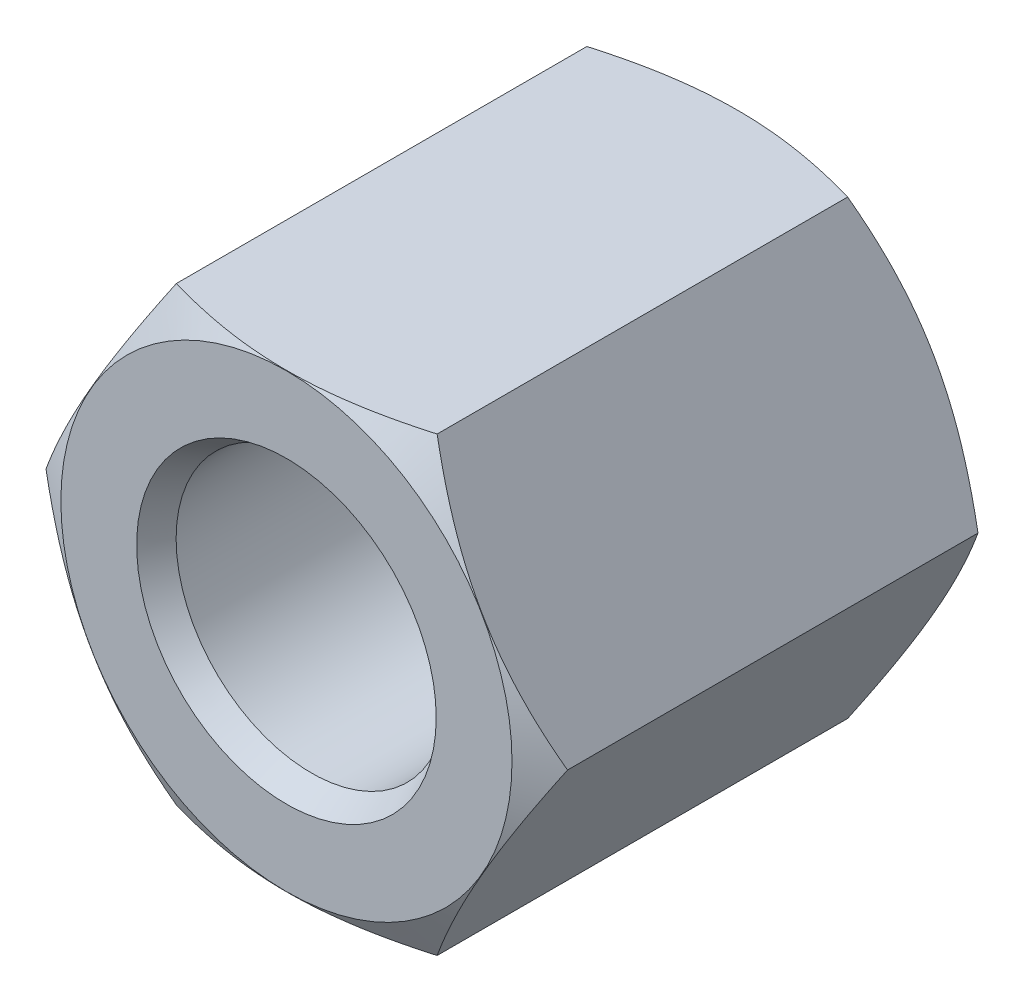
ISO-10303-21;
HEADER;
FILE_DESCRIPTION(('STEP AP214'),'2;1');
FILE_NAME('part.step','',(''),(''),'','','');
FILE_SCHEMA(('AUTOMOTIVE_DESIGN { 1 0 10303 214 1 1 1 1 }'));
ENDSEC;
DATA;
#1=APPLICATION_CONTEXT('core data for automotive mechanical design processes');
#2=APPLICATION_PROTOCOL_DEFINITION('international standard','automotive_design',2000,#1);
#3=PRODUCT_CONTEXT('',#1,'mechanical');
#4=PRODUCT('Part','Part','',(#3));
#5=PRODUCT_RELATED_PRODUCT_CATEGORY('part','',(#4));
#6=PRODUCT_DEFINITION_FORMATION('','',#4);
#7=PRODUCT_DEFINITION_CONTEXT('part definition',#1,'design');
#8=PRODUCT_DEFINITION('design','',#6,#7);
#9=PRODUCT_DEFINITION_SHAPE('','',#8);
#10=(LENGTH_UNIT() NAMED_UNIT(*) SI_UNIT(.MILLI.,.METRE.));
#11=(NAMED_UNIT(*) PLANE_ANGLE_UNIT() SI_UNIT($,.RADIAN.));
#12=(NAMED_UNIT(*) SI_UNIT($,.STERADIAN.) SOLID_ANGLE_UNIT());
#13=UNCERTAINTY_MEASURE_WITH_UNIT(LENGTH_MEASURE(1.E-05),#10,'distance_accuracy_value','');
#14=(GEOMETRIC_REPRESENTATION_CONTEXT(3) GLOBAL_UNCERTAINTY_ASSIGNED_CONTEXT((#13)) GLOBAL_UNIT_ASSIGNED_CONTEXT((#10,
#11,#12)) REPRESENTATION_CONTEXT('',''));
#15=CARTESIAN_POINT('',(0.,0.,0.));
#16=DIRECTION('',(0.,0.,1.));
#17=DIRECTION('',(1.,0.,0.));
#18=AXIS2_PLACEMENT_3D('',#15,#16,#17);
#19=CARTESIAN_POINT('',(0.,0.,4.72287187079));
#20=DIRECTION('',(0.,0.,-1.));
#21=DIRECTION('',(1.,0.,0.));
#22=AXIS2_PLACEMENT_3D('',#19,#20,#21);
#23=CYLINDRICAL_SURFACE('',#22,1.5);
#24=CARTESIAN_POINT('',(0.,0.,4.72287187079));
#25=DIRECTION('',(0.,0.,1.));
#26=DIRECTION('',(1.,0.,0.));
#27=AXIS2_PLACEMENT_3D('',#24,#25,#26);
#28=CIRCLE('',#27,1.5);
#29=CARTESIAN_POINT('',(1.5,0.,4.72287187079));
#30=VERTEX_POINT('',#29);
#31=EDGE_CURVE('E132',#30,#30,#28,.T.);
#32=ORIENTED_EDGE('',*,*,#31,.T.);
#33=DIRECTION('',(0.,0.,-1.));
#34=VECTOR('',#33,1.);
#35=CARTESIAN_POINT('',(1.5,0.,4.72287187079));
#36=LINE('',#35,#34);
#37=CARTESIAN_POINT('',(1.5,0.,2.5));
#38=VERTEX_POINT('',#37);
#39=EDGE_CURVE('E10',#30,#38,#36,.T.);
#40=ORIENTED_EDGE('',*,*,#39,.T.);
#41=CARTESIAN_POINT('',(0.,0.,2.5));
#42=DIRECTION('',(0.,0.,1.));
#43=DIRECTION('',(1.,0.,0.));
#44=AXIS2_PLACEMENT_3D('',#41,#42,#43);
#45=CIRCLE('',#44,1.5);
#46=EDGE_CURVE('E134',#38,#38,#45,.T.);
#47=ORIENTED_EDGE('',*,*,#46,.F.);
#48=ORIENTED_EDGE('',*,*,#39,.F.);
#49=EDGE_LOOP('',(#32,#40,#47,#48));
#50=FACE_BOUND('',#49,.T.);
#51=ADVANCED_FACE('F15',(#50),#23,.F.);
#52=CARTESIAN_POINT('',(0.,0.,2.5));
#53=DIRECTION('',(0.,0.,-1.));
#54=DIRECTION('',(1.,0.,0.));
#55=AXIS2_PLACEMENT_3D('',#52,#53,#54);
#56=CYLINDRICAL_SURFACE('',#55,1.5);
#57=ORIENTED_EDGE('',*,*,#46,.T.);
#58=DIRECTION('',(0.,0.,-1.));
#59=VECTOR('',#58,1.);
#60=CARTESIAN_POINT('',(1.5,0.,2.5));
#61=LINE('',#60,#59);
#62=CARTESIAN_POINT('',(1.5,0.,0.27712812921));
#63=VERTEX_POINT('',#62);
#64=EDGE_CURVE('E19',#38,#63,#61,.T.);
#65=ORIENTED_EDGE('',*,*,#64,.T.);
#66=CARTESIAN_POINT('',(0.,0.,0.27712812921));
#67=DIRECTION('',(0.,0.,1.));
#68=DIRECTION('',(1.,0.,0.));
#69=AXIS2_PLACEMENT_3D('',#66,#67,#68);
#70=CIRCLE('',#69,1.5);
#71=EDGE_CURVE('E190',#63,#63,#70,.T.);
#72=ORIENTED_EDGE('',*,*,#71,.F.);
#73=ORIENTED_EDGE('',*,*,#64,.F.);
#74=EDGE_LOOP('',(#57,#65,#72,#73));
#75=FACE_BOUND('',#74,.T.);
#76=ADVANCED_FACE('F310',(#75),#56,.F.);
#77=CARTESIAN_POINT('',(0.,0.,5.));
#78=DIRECTION('',(0.,0.,1.));
#79=DIRECTION('',(1.,0.,0.));
#80=AXIS2_PLACEMENT_3D('',#77,#78,#79);
#81=CONICAL_SURFACE('',#80,1.66,0.5235987756);
#82=CARTESIAN_POINT('',(0.,0.,5.));
#83=DIRECTION('',(0.,0.,1.));
#84=DIRECTION('',(1.,0.,0.));
#85=AXIS2_PLACEMENT_3D('',#82,#83,#84);
#86=CIRCLE('',#85,1.66);
#87=CARTESIAN_POINT('',(1.66,0.,5.));
#88=VERTEX_POINT('',#87);
#89=EDGE_CURVE('E168',#88,#88,#86,.T.);
#90=ORIENTED_EDGE('',*,*,#89,.T.);
#91=DIRECTION('',(-0.50000000000094,0.,-0.866025403783896));
#92=VECTOR('',#91,1.);
#93=CARTESIAN_POINT('',(1.66,0.,5.));
#94=LINE('',#93,#92);
#95=EDGE_CURVE('E135',#88,#30,#94,.T.);
#96=ORIENTED_EDGE('',*,*,#95,.T.);
#97=ORIENTED_EDGE('',*,*,#31,.F.);
#98=ORIENTED_EDGE('',*,*,#95,.F.);
#99=EDGE_LOOP('',(#90,#96,#97,#98));
#100=FACE_BOUND('',#99,.T.);
#101=ADVANCED_FACE('F315',(#100),#81,.F.);
#102=CARTESIAN_POINT('',(0.,0.,0.27712812921));
#103=DIRECTION('',(0.,0.,-1.));
#104=DIRECTION('',(1.,0.,0.));
#105=AXIS2_PLACEMENT_3D('',#102,#103,#104);
#106=CONICAL_SURFACE('',#105,1.5,0.5235987756);
#107=ORIENTED_EDGE('',*,*,#71,.T.);
#108=DIRECTION('',(0.50000000000094,0.,-0.866025403783896));
#109=VECTOR('',#108,1.);
#110=CARTESIAN_POINT('',(1.5,0.,0.27712812921));
#111=LINE('',#110,#109);
#112=CARTESIAN_POINT('',(1.66,0.,0.));
#113=VERTEX_POINT('',#112);
#114=EDGE_CURVE('E246',#63,#113,#111,.T.);
#115=ORIENTED_EDGE('',*,*,#114,.T.);
#116=CARTESIAN_POINT('',(0.,0.,0.));
#117=DIRECTION('',(0.,0.,1.));
#118=DIRECTION('',(1.,0.,0.));
#119=AXIS2_PLACEMENT_3D('',#116,#117,#118);
#120=CIRCLE('',#119,1.66);
#121=EDGE_CURVE('E164',#113,#113,#120,.T.);
#122=ORIENTED_EDGE('',*,*,#121,.F.);
#123=ORIENTED_EDGE('',*,*,#114,.F.);
#124=EDGE_LOOP('',(#107,#115,#122,#123));
#125=FACE_BOUND('',#124,.T.);
#126=ADVANCED_FACE('F289',(#125),#106,.F.);
#127=CARTESIAN_POINT('',(0.,0.,5.));
#128=DIRECTION('',(0.,0.,1.));
#129=DIRECTION('',(1.,0.,0.));
#130=AXIS2_PLACEMENT_3D('',#127,#128,#129);
#131=PLANE('',#130);
#132=ORIENTED_EDGE('',*,*,#89,.F.);
#133=EDGE_LOOP('',(#132));
#134=FACE_BOUND('',#133,.T.);
#135=CARTESIAN_POINT('',(0.,0.,5.));
#136=DIRECTION('',(0.,0.,1.));
#137=DIRECTION('',(1.,0.,0.));
#138=AXIS2_PLACEMENT_3D('',#135,#136,#137);
#139=CIRCLE('',#138,2.5);
#140=CARTESIAN_POINT('',(2.5,0.,5.));
#141=VERTEX_POINT('',#140);
#142=EDGE_CURVE('E111',#141,#141,#139,.T.);
#143=ORIENTED_EDGE('',*,*,#142,.T.);
#144=EDGE_LOOP('',(#143));
#145=FACE_BOUND('',#144,.T.);
#146=ADVANCED_FACE('F112',(#134,#145),#131,.T.);
#147=CARTESIAN_POINT('',(0.,0.,0.));
#148=DIRECTION('',(0.,0.,1.));
#149=DIRECTION('',(1.,0.,0.));
#150=AXIS2_PLACEMENT_3D('',#147,#148,#149);
#151=PLANE('',#150);
#152=CARTESIAN_POINT('',(0.,0.,0.));
#153=DIRECTION('',(0.,0.,1.));
#154=DIRECTION('',(1.,0.,0.));
#155=AXIS2_PLACEMENT_3D('',#152,#153,#154);
#156=CIRCLE('',#155,2.5);
#157=CARTESIAN_POINT('',(2.5,0.,0.));
#158=VERTEX_POINT('',#157);
#159=EDGE_CURVE('E142',#158,#158,#156,.T.);
#160=ORIENTED_EDGE('',*,*,#159,.F.);
#161=EDGE_LOOP('',(#160));
#162=FACE_BOUND('',#161,.T.);
#163=ORIENTED_EDGE('',*,*,#121,.T.);
#164=EDGE_LOOP('',(#163));
#165=FACE_BOUND('',#164,.T.);
#166=ADVANCED_FACE('F291',(#162,#165),#151,.F.);
#167=CARTESIAN_POINT('',(-1.445,-2.502813416937,0.));
#168=DIRECTION('',(0.,1.,0.));
#169=DIRECTION('',(1.,0.,0.));
#170=AXIS2_PLACEMENT_3D('',#167,#168,#169);
#171=PLANE('',#170);
#172=DIRECTION('',(0.,0.,1.));
#173=VECTOR('',#172,1.);
#174=CARTESIAN_POINT('',(1.445,-2.502813416937,0.));
#175=LINE('',#174,#173);
#176=CARTESIAN_POINT('',(1.445,-2.502813416937,0.225166604984));
#177=VERTEX_POINT('',#176);
#178=CARTESIAN_POINT('',(1.445,-2.502813416937,4.774833395016));
#179=VERTEX_POINT('',#178);
#180=EDGE_CURVE('E149',#177,#179,#175,.T.);
#181=ORIENTED_EDGE('',*,*,#180,.T.);
#182=CARTESIAN_POINT('',(1.44500000000008,-2.502813416937,4.77483339501595));
#183=CARTESIAN_POINT('',(0.,-2.50281341693702,5.1919689645055));
#184=CARTESIAN_POINT('',(-1.44499999999997,-2.502813416937,4.77483339501598));
#185=(BOUNDED_CURVE() B_SPLINE_CURVE(2,(#182,#183,#184),.UNSPECIFIED.,.F.,
.F.) B_SPLINE_CURVE_WITH_KNOTS((3,3),(0.,1.),
.UNSPECIFIED.) CURVE() GEOMETRIC_REPRESENTATION_ITEM() RATIONAL_B_SPLINE_CURVE((1.,
1.15470053837926,1.)) REPRESENTATION_ITEM(''));
#186=CARTESIAN_POINT('',(-1.445,-2.502813416937,4.774833395016));
#187=VERTEX_POINT('',#186);
#188=EDGE_CURVE('E152',#179,#187,#185,.T.);
#189=ORIENTED_EDGE('',*,*,#188,.T.);
#190=DIRECTION('',(0.,0.,1.));
#191=VECTOR('',#190,1.);
#192=CARTESIAN_POINT('',(-1.445,-2.502813416937,0.));
#193=LINE('',#192,#191);
#194=CARTESIAN_POINT('',(-1.445,-2.502813416937,0.225166604984));
#195=VERTEX_POINT('',#194);
#196=EDGE_CURVE('E148',#195,#187,#193,.T.);
#197=ORIENTED_EDGE('',*,*,#196,.F.);
#198=CARTESIAN_POINT('',(-1.44500000000008,-2.502813416937,0.225166604984046));
#199=CARTESIAN_POINT('',(0.,-2.50281341693701,-0.191968964505495));
#200=CARTESIAN_POINT('',(1.44499999999997,-2.502813416937,0.225166604984016));
#201=(BOUNDED_CURVE() B_SPLINE_CURVE(2,(#198,#199,#200),.UNSPECIFIED.,.F.,
.F.) B_SPLINE_CURVE_WITH_KNOTS((3,3),(0.,1.),
.UNSPECIFIED.) CURVE() GEOMETRIC_REPRESENTATION_ITEM() RATIONAL_B_SPLINE_CURVE((1.,
1.15470053837926,1.)) REPRESENTATION_ITEM(''));
#202=EDGE_CURVE('E141',#195,#177,#201,.T.);
#203=ORIENTED_EDGE('',*,*,#202,.T.);
#204=EDGE_LOOP('',(#181,#189,#197,#203));
#205=FACE_BOUND('',#204,.T.);
#206=ADVANCED_FACE('F293',(#205),#171,.F.);
#207=CARTESIAN_POINT('',(-2.89,0.,0.));
#208=DIRECTION('',(0.866025403784329,0.50000000000019,0.));
#209=DIRECTION('',(0.,0.,-1.));
#210=AXIS2_PLACEMENT_3D('',#207,#208,#209);
#211=PLANE('',#210);
#212=ORIENTED_EDGE('',*,*,#196,.T.);
#213=CARTESIAN_POINT('',(-1.44499999999986,-2.50281341693713,4.77483339501589));
#214=CARTESIAN_POINT('',(-2.16750000000006,-1.25140670846891,5.19196896450558));
#215=CARTESIAN_POINT('',(-2.89000000000029,-6.22391027604863E-13,4.77483339501581));
#216=(BOUNDED_CURVE() B_SPLINE_CURVE(2,(#213,#214,#215),.UNSPECIFIED.,.F.,
.F.) B_SPLINE_CURVE_WITH_KNOTS((3,3),(0.,1.),
.UNSPECIFIED.) CURVE() GEOMETRIC_REPRESENTATION_ITEM() RATIONAL_B_SPLINE_CURVE((1.,
1.15470053837934,1.)) REPRESENTATION_ITEM(''));
#217=CARTESIAN_POINT('',(-2.89,0.,4.774833395016));
#218=VERTEX_POINT('',#217);
#219=EDGE_CURVE('E123',#187,#218,#216,.T.);
#220=ORIENTED_EDGE('',*,*,#219,.T.);
#221=DIRECTION('',(0.,0.,1.));
#222=VECTOR('',#221,1.);
#223=CARTESIAN_POINT('',(-2.89,0.,0.));
#224=LINE('',#223,#222);
#225=CARTESIAN_POINT('',(-2.89,0.,0.225166604984));
#226=VERTEX_POINT('',#225);
#227=EDGE_CURVE('E104',#226,#218,#224,.T.);
#228=ORIENTED_EDGE('',*,*,#227,.F.);
#229=CARTESIAN_POINT('',(-2.89000000000094,5.09592368302947E-13,0.225166604984566));
#230=CARTESIAN_POINT('',(-2.16750000000034,-1.2514067084684,-0.191968964505698));
#231=CARTESIAN_POINT('',(-1.44499999999998,-2.50281341693691,0.225166604984036));
#232=(BOUNDED_CURVE() B_SPLINE_CURVE(2,(#229,#230,#231),.UNSPECIFIED.,.F.,
.F.) B_SPLINE_CURVE_WITH_KNOTS((3,3),(0.,1.),
.UNSPECIFIED.) CURVE() GEOMETRIC_REPRESENTATION_ITEM() RATIONAL_B_SPLINE_CURVE((1.,
1.15470053837945,1.)) REPRESENTATION_ITEM(''));
#233=EDGE_CURVE('E158',#226,#195,#232,.T.);
#234=ORIENTED_EDGE('',*,*,#233,.T.);
#235=EDGE_LOOP('',(#212,#220,#228,#234));
#236=FACE_BOUND('',#235,.T.);
#237=ADVANCED_FACE('F301',(#236),#211,.F.);
#238=CARTESIAN_POINT('',(-1.445,2.502813416937,0.));
#239=DIRECTION('',(0.866025403784329,-0.50000000000019,0.));
#240=DIRECTION('',(0.,0.,-1.));
#241=AXIS2_PLACEMENT_3D('',#238,#239,#240);
#242=PLANE('',#241);
#243=ORIENTED_EDGE('',*,*,#227,.T.);
#244=CARTESIAN_POINT('',(-2.89000000000108,-7.4718009557273E-13,4.77483339501536));
#245=CARTESIAN_POINT('',(-2.1675000000004,1.25140670846831,5.19196896450573));
#246=CARTESIAN_POINT('',(-1.44499999999998,2.50281341693692,4.77483339501596));
#247=(BOUNDED_CURVE() B_SPLINE_CURVE(2,(#244,#245,#246),.UNSPECIFIED.,.F.,
.F.) B_SPLINE_CURVE_WITH_KNOTS((3,3),(0.,1.),
.UNSPECIFIED.) CURVE() GEOMETRIC_REPRESENTATION_ITEM() RATIONAL_B_SPLINE_CURVE((1.,
1.15470053837947,1.)) REPRESENTATION_ITEM(''));
#248=CARTESIAN_POINT('',(-1.445,2.502813416937,4.774833395016));
#249=VERTEX_POINT('',#248);
#250=EDGE_CURVE('E116',#218,#249,#247,.T.);
#251=ORIENTED_EDGE('',*,*,#250,.T.);
#252=DIRECTION('',(0.,0.,1.));
#253=VECTOR('',#252,1.);
#254=CARTESIAN_POINT('',(-1.445,2.502813416937,0.));
#255=LINE('',#254,#253);
#256=CARTESIAN_POINT('',(-1.445,2.502813416937,0.225166604984));
#257=VERTEX_POINT('',#256);
#258=EDGE_CURVE('E130',#257,#249,#255,.T.);
#259=ORIENTED_EDGE('',*,*,#258,.F.);
#260=CARTESIAN_POINT('',(-1.44499999999986,2.50281341693713,0.225166604984106));
#261=CARTESIAN_POINT('',(-2.16750000000007,1.25140670846888,-0.191968964505593));
#262=CARTESIAN_POINT('',(-2.89000000000033,5.42899059041702E-13,0.225166604984216));
#263=(BOUNDED_CURVE() B_SPLINE_CURVE(2,(#260,#261,#262),.UNSPECIFIED.,.F.,
.F.) B_SPLINE_CURVE_WITH_KNOTS((3,3),(0.,1.),
.UNSPECIFIED.) CURVE() GEOMETRIC_REPRESENTATION_ITEM() RATIONAL_B_SPLINE_CURVE((1.,
1.15470053837935,1.)) REPRESENTATION_ITEM(''));
#264=EDGE_CURVE('E174',#257,#226,#263,.T.);
#265=ORIENTED_EDGE('',*,*,#264,.T.);
#266=EDGE_LOOP('',(#243,#251,#259,#265));
#267=FACE_BOUND('',#266,.T.);
#268=ADVANCED_FACE('F341',(#267),#242,.F.);
#269=CARTESIAN_POINT('',(1.445,-2.502813416937,0.));
#270=DIRECTION('',(-0.866025403784329,0.50000000000019,0.));
#271=DIRECTION('',(0.,0.,1.));
#272=AXIS2_PLACEMENT_3D('',#269,#270,#271);
#273=PLANE('',#272);
#274=DIRECTION('',(0.,0.,1.));
#275=VECTOR('',#274,1.);
#276=CARTESIAN_POINT('',(2.89,0.,0.225166604984));
#277=LINE('',#276,#275);
#278=CARTESIAN_POINT('',(2.89,0.,0.225166604984));
#279=VERTEX_POINT('',#278);
#280=CARTESIAN_POINT('',(2.89,0.,4.774833395016));
#281=VERTEX_POINT('',#280);
#282=EDGE_CURVE('E221',#279,#281,#277,.T.);
#283=ORIENTED_EDGE('',*,*,#282,.T.);
#284=CARTESIAN_POINT('',(2.89000000000101,6.29496454962464E-13,4.77483339501539));
#285=CARTESIAN_POINT('',(2.16750000000037,-1.25140670846836,5.19196896450572));
#286=CARTESIAN_POINT('',(1.44499999999998,-2.50281341693692,4.77483339501596));
#287=(BOUNDED_CURVE() B_SPLINE_CURVE(2,(#284,#285,#286),.UNSPECIFIED.,.F.,
.F.) B_SPLINE_CURVE_WITH_KNOTS((3,3),(0.,1.),
.UNSPECIFIED.) CURVE() GEOMETRIC_REPRESENTATION_ITEM() RATIONAL_B_SPLINE_CURVE((1.,
1.15470053837946,1.)) REPRESENTATION_ITEM(''));
#288=EDGE_CURVE('E126',#281,#179,#287,.T.);
#289=ORIENTED_EDGE('',*,*,#288,.T.);
#290=ORIENTED_EDGE('',*,*,#180,.F.);
#291=CARTESIAN_POINT('',(1.44499999999986,-2.50281341693713,0.225166604984106));
#292=CARTESIAN_POINT('',(2.16750000000006,-1.25140670846889,-0.191968964505588));
#293=CARTESIAN_POINT('',(2.89000000000031,-5.83089132533132E-13,0.225166604984202));
#294=(BOUNDED_CURVE() B_SPLINE_CURVE(2,(#291,#292,#293),.UNSPECIFIED.,.F.,
.F.) B_SPLINE_CURVE_WITH_KNOTS((3,3),(0.,1.),
.UNSPECIFIED.) CURVE() GEOMETRIC_REPRESENTATION_ITEM() RATIONAL_B_SPLINE_CURVE((1.,
1.15470053837935,1.)) REPRESENTATION_ITEM(''));
#295=EDGE_CURVE('E136',#177,#279,#294,.T.);
#296=ORIENTED_EDGE('',*,*,#295,.T.);
#297=EDGE_LOOP('',(#283,#289,#290,#296));
#298=FACE_BOUND('',#297,.T.);
#299=ADVANCED_FACE('F17',(#298),#273,.F.);
#300=CARTESIAN_POINT('',(0.,0.,4.774833395016));
#301=DIRECTION('',(0.,0.,-1.));
#302=DIRECTION('',(1.,0.,0.));
#303=AXIS2_PLACEMENT_3D('',#300,#301,#302);
#304=CONICAL_SURFACE('',#303,2.89,1.047197551197);
#305=ORIENTED_EDGE('',*,*,#288,.F.);
#306=DIRECTION('',(-0.866025403784329,0.,0.50000000000019));
#307=VECTOR('',#306,1.);
#308=CARTESIAN_POINT('',(2.89,0.,4.774833395016));
#309=LINE('',#308,#307);
#310=EDGE_CURVE('E117',#281,#141,#309,.T.);
#311=ORIENTED_EDGE('',*,*,#310,.T.);
#312=ORIENTED_EDGE('',*,*,#142,.F.);
#313=ORIENTED_EDGE('',*,*,#310,.F.);
#314=CARTESIAN_POINT('',(1.44499999999986,2.50281341693713,4.77483339501589));
#315=CARTESIAN_POINT('',(2.16750000000006,1.25140670846889,5.19196896450558));
#316=CARTESIAN_POINT('',(2.89000000000031,5.83311177138057E-13,4.7748333950158));
#317=(BOUNDED_CURVE() B_SPLINE_CURVE(2,(#314,#315,#316),.UNSPECIFIED.,.F.,
.F.) B_SPLINE_CURVE_WITH_KNOTS((3,3),(0.,1.),
.UNSPECIFIED.) CURVE() GEOMETRIC_REPRESENTATION_ITEM() RATIONAL_B_SPLINE_CURVE((1.,
1.15470053837934,1.)) REPRESENTATION_ITEM(''));
#318=CARTESIAN_POINT('',(1.445,2.502813416937,4.774833395016));
#319=VERTEX_POINT('',#318);
#320=EDGE_CURVE('E197',#319,#281,#317,.T.);
#321=ORIENTED_EDGE('',*,*,#320,.F.);
#322=CARTESIAN_POINT('',(-1.44500000000008,2.502813416937,4.77483339501595));
#323=CARTESIAN_POINT('',(0.,2.50281341693702,5.1919689645055));
#324=CARTESIAN_POINT('',(1.44499999999997,2.502813416937,4.77483339501598));
#325=(BOUNDED_CURVE() B_SPLINE_CURVE(2,(#322,#323,#324),.UNSPECIFIED.,.F.,
.F.) B_SPLINE_CURVE_WITH_KNOTS((3,3),(0.,1.),
.UNSPECIFIED.) CURVE() GEOMETRIC_REPRESENTATION_ITEM() RATIONAL_B_SPLINE_CURVE((1.,
1.15470053837926,1.)) REPRESENTATION_ITEM(''));
#326=EDGE_CURVE('E183',#249,#319,#325,.T.);
#327=ORIENTED_EDGE('',*,*,#326,.F.);
#328=ORIENTED_EDGE('',*,*,#250,.F.);
#329=ORIENTED_EDGE('',*,*,#219,.F.);
#330=ORIENTED_EDGE('',*,*,#188,.F.);
#331=EDGE_LOOP('',(#305,#311,#312,#313,#321,#327,#328,#329,#330));
#332=FACE_BOUND('',#331,.T.);
#333=ADVANCED_FACE('F329',(#332),#304,.T.);
#334=CARTESIAN_POINT('',(1.445,2.502813416937,0.));
#335=DIRECTION('',(0.,-1.,0.));
#336=DIRECTION('',(-1.,0.,0.));
#337=AXIS2_PLACEMENT_3D('',#334,#335,#336);
#338=PLANE('',#337);
#339=ORIENTED_EDGE('',*,*,#258,.T.);
#340=ORIENTED_EDGE('',*,*,#326,.T.);
#341=DIRECTION('',(0.,0.,1.));
#342=VECTOR('',#341,1.);
#343=CARTESIAN_POINT('',(1.445,2.502813416937,0.));
#344=LINE('',#343,#342);
#345=CARTESIAN_POINT('',(1.445,2.502813416937,0.225166604984));
#346=VERTEX_POINT('',#345);
#347=EDGE_CURVE('E194',#346,#319,#344,.T.);
#348=ORIENTED_EDGE('',*,*,#347,.F.);
#349=CARTESIAN_POINT('',(1.44500000000008,2.502813416937,0.225166604984046));
#350=CARTESIAN_POINT('',(0.,2.50281341693701,-0.191968964505495));
#351=CARTESIAN_POINT('',(-1.44499999999997,2.502813416937,0.225166604984016));
#352=(BOUNDED_CURVE() B_SPLINE_CURVE(2,(#349,#350,#351),.UNSPECIFIED.,.F.,
.F.) B_SPLINE_CURVE_WITH_KNOTS((3,3),(0.,1.),
.UNSPECIFIED.) CURVE() GEOMETRIC_REPRESENTATION_ITEM() RATIONAL_B_SPLINE_CURVE((1.,
1.15470053837926,1.)) REPRESENTATION_ITEM(''));
#353=EDGE_CURVE('E250',#346,#257,#352,.T.);
#354=ORIENTED_EDGE('',*,*,#353,.T.);
#355=EDGE_LOOP('',(#339,#340,#348,#354));
#356=FACE_BOUND('',#355,.T.);
#357=ADVANCED_FACE('F322',(#356),#338,.F.);
#358=CARTESIAN_POINT('',(0.,0.,0.));
#359=DIRECTION('',(0.,0.,1.));
#360=DIRECTION('',(1.,0.,0.));
#361=AXIS2_PLACEMENT_3D('',#358,#359,#360);
#362=CONICAL_SURFACE('',#361,2.5,1.047197551197);
#363=DIRECTION('',(0.866025403784329,0.,0.50000000000019));
#364=VECTOR('',#363,1.);
#365=CARTESIAN_POINT('',(2.5,0.,0.));
#366=LINE('',#365,#364);
#367=EDGE_CURVE('E193',#158,#279,#366,.T.);
#368=ORIENTED_EDGE('',*,*,#367,.F.);
#369=ORIENTED_EDGE('',*,*,#159,.T.);
#370=ORIENTED_EDGE('',*,*,#367,.T.);
#371=ORIENTED_EDGE('',*,*,#295,.F.);
#372=ORIENTED_EDGE('',*,*,#202,.F.);
#373=ORIENTED_EDGE('',*,*,#233,.F.);
#374=ORIENTED_EDGE('',*,*,#264,.F.);
#375=ORIENTED_EDGE('',*,*,#353,.F.);
#376=CARTESIAN_POINT('',(2.89000000000101,-6.28830321147689E-13,0.225166604984606));
#377=CARTESIAN_POINT('',(2.16750000000037,1.25140670846836,-0.191968964505713));
#378=CARTESIAN_POINT('',(1.44499999999998,2.50281341693691,0.225166604984036));
#379=(BOUNDED_CURVE() B_SPLINE_CURVE(2,(#376,#377,#378),.UNSPECIFIED.,.F.,
.F.) B_SPLINE_CURVE_WITH_KNOTS((3,3),(0.,1.),
.UNSPECIFIED.) CURVE() GEOMETRIC_REPRESENTATION_ITEM() RATIONAL_B_SPLINE_CURVE((1.,
1.15470053837946,1.)) REPRESENTATION_ITEM(''));
#380=EDGE_CURVE('E213',#279,#346,#379,.T.);
#381=ORIENTED_EDGE('',*,*,#380,.F.);
#382=EDGE_LOOP('',(#368,#369,#370,#371,#372,#373,#374,#375,#381));
#383=FACE_BOUND('',#382,.T.);
#384=ADVANCED_FACE('F319',(#383),#362,.T.);
#385=CARTESIAN_POINT('',(2.89,0.,0.));
#386=DIRECTION('',(-0.866025403784329,-0.50000000000019,0.));
#387=DIRECTION('',(-0.50000000000019,0.866025403784329,0.));
#388=AXIS2_PLACEMENT_3D('',#385,#386,#387);
#389=PLANE('',#388);
#390=ORIENTED_EDGE('',*,*,#347,.T.);
#391=ORIENTED_EDGE('',*,*,#320,.T.);
#392=ORIENTED_EDGE('',*,*,#282,.F.);
#393=ORIENTED_EDGE('',*,*,#380,.T.);
#394=EDGE_LOOP('',(#390,#391,#392,#393));
#395=FACE_BOUND('',#394,.T.);
#396=ADVANCED_FACE('F321',(#395),#389,.F.);
#397=CLOSED_SHELL('',(#51,#76,#101,#126,#146,#166,#206,#237,#268,#299,#333,#357,#384,#396));
#398=MANIFOLD_SOLID_BREP('B1',#397);
#399=ADVANCED_BREP_SHAPE_REPRESENTATION('',(#18,#398),#14);
#400=SHAPE_DEFINITION_REPRESENTATION(#9,#399);
ENDSEC;
END-ISO-10303-21;
